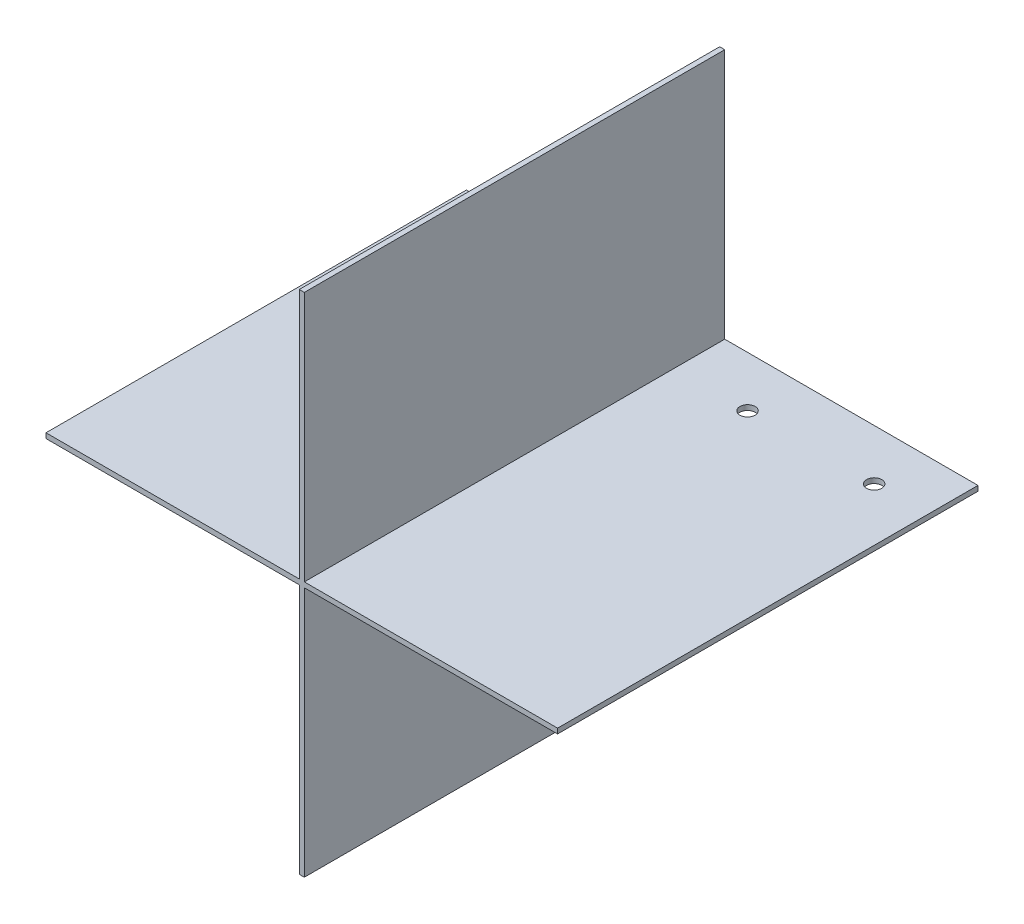
ISO-10303-21;
HEADER;
FILE_DESCRIPTION(('STEP AP214'),'2;1');
FILE_NAME('part.step','',(''),(''),'','','');
FILE_SCHEMA(('AUTOMOTIVE_DESIGN { 1 0 10303 214 1 1 1 1 }'));
ENDSEC;
DATA;
#1=APPLICATION_CONTEXT('core data for automotive mechanical design processes');
#2=APPLICATION_PROTOCOL_DEFINITION('international standard','automotive_design',2000,#1);
#3=PRODUCT_CONTEXT('',#1,'mechanical');
#4=PRODUCT('Part','Part','',(#3));
#5=PRODUCT_RELATED_PRODUCT_CATEGORY('part','',(#4));
#6=PRODUCT_DEFINITION_FORMATION('','',#4);
#7=PRODUCT_DEFINITION_CONTEXT('part definition',#1,'design');
#8=PRODUCT_DEFINITION('design','',#6,#7);
#9=PRODUCT_DEFINITION_SHAPE('','',#8);
#10=(LENGTH_UNIT() NAMED_UNIT(*) SI_UNIT(.MILLI.,.METRE.));
#11=(NAMED_UNIT(*) PLANE_ANGLE_UNIT() SI_UNIT($,.RADIAN.));
#12=(NAMED_UNIT(*) SI_UNIT($,.STERADIAN.) SOLID_ANGLE_UNIT());
#13=UNCERTAINTY_MEASURE_WITH_UNIT(LENGTH_MEASURE(1.E-05),#10,'distance_accuracy_value','');
#14=(GEOMETRIC_REPRESENTATION_CONTEXT(3) GLOBAL_UNCERTAINTY_ASSIGNED_CONTEXT((#13)) GLOBAL_UNIT_ASSIGNED_CONTEXT((#10,
#11,#12)) REPRESENTATION_CONTEXT('',''));
#15=CARTESIAN_POINT('',(0.,0.,0.));
#16=DIRECTION('',(0.,0.,1.));
#17=DIRECTION('',(1.,0.,0.));
#18=AXIS2_PLACEMENT_3D('',#15,#16,#17);
#19=CARTESIAN_POINT('',(-0.5,0.,0.));
#20=DIRECTION('',(1.,0.,0.));
#21=DIRECTION('',(0.,0.,-1.));
#22=AXIS2_PLACEMENT_3D('',#19,#20,#21);
#23=PLANE('',#22);
#24=DIRECTION('',(0.,-1.,0.));
#25=VECTOR('',#24,1.);
#26=CARTESIAN_POINT('',(-0.5,50.,41.5));
#27=LINE('',#26,#25);
#28=CARTESIAN_POINT('',(-0.5,-0.5,41.5));
#29=VERTEX_POINT('',#28);
#30=CARTESIAN_POINT('',(-0.5,-50.,41.5));
#31=VERTEX_POINT('',#30);
#32=EDGE_CURVE('E226',#29,#31,#27,.T.);
#33=ORIENTED_EDGE('',*,*,#32,.F.);
#34=DIRECTION('',(0.,0.,-1.));
#35=VECTOR('',#34,1.);
#36=CARTESIAN_POINT('',(-0.5,-0.5,0.));
#37=LINE('',#36,#35);
#38=CARTESIAN_POINT('',(-0.5,-0.5,-41.5));
#39=VERTEX_POINT('',#38);
#40=EDGE_CURVE('E198',#29,#39,#37,.T.);
#41=ORIENTED_EDGE('',*,*,#40,.T.);
#42=DIRECTION('',(0.,1.,0.));
#43=VECTOR('',#42,1.);
#44=CARTESIAN_POINT('',(-0.5,50.,-41.5));
#45=LINE('',#44,#43);
#46=CARTESIAN_POINT('',(-0.5,-50.,-41.5));
#47=VERTEX_POINT('',#46);
#48=EDGE_CURVE('E218',#47,#39,#45,.T.);
#49=ORIENTED_EDGE('',*,*,#48,.F.);
#50=DIRECTION('',(0.,0.,-1.));
#51=VECTOR('',#50,1.);
#52=CARTESIAN_POINT('',(-0.5,-50.,41.5));
#53=LINE('',#52,#51);
#54=EDGE_CURVE('E231',#31,#47,#53,.T.);
#55=ORIENTED_EDGE('',*,*,#54,.F.);
#56=EDGE_LOOP('',(#33,#41,#49,#55));
#57=FACE_BOUND('',#56,.T.);
#58=ADVANCED_FACE('F38',(#57),#23,.F.);
#59=CARTESIAN_POINT('',(0.5,0.,0.));
#60=DIRECTION('',(1.,0.,0.));
#61=DIRECTION('',(0.,0.,-1.));
#62=AXIS2_PLACEMENT_3D('',#59,#60,#61);
#63=PLANE('',#62);
#64=DIRECTION('',(0.,0.,-1.));
#65=VECTOR('',#64,1.);
#66=CARTESIAN_POINT('',(0.5,-0.5,0.));
#67=LINE('',#66,#65);
#68=CARTESIAN_POINT('',(0.5,-0.5,41.5));
#69=VERTEX_POINT('',#68);
#70=CARTESIAN_POINT('',(0.5,-0.5,-41.5));
#71=VERTEX_POINT('',#70);
#72=EDGE_CURVE('E11',#69,#71,#67,.T.);
#73=ORIENTED_EDGE('',*,*,#72,.F.);
#74=DIRECTION('',(0.,-1.,0.));
#75=VECTOR('',#74,1.);
#76=CARTESIAN_POINT('',(0.5,50.,41.5));
#77=LINE('',#76,#75);
#78=CARTESIAN_POINT('',(0.5,-50.,41.5));
#79=VERTEX_POINT('',#78);
#80=EDGE_CURVE('E209',#69,#79,#77,.T.);
#81=ORIENTED_EDGE('',*,*,#80,.T.);
#82=DIRECTION('',(0.,0.,-1.));
#83=VECTOR('',#82,1.);
#84=CARTESIAN_POINT('',(0.5,-50.,41.5));
#85=LINE('',#84,#83);
#86=CARTESIAN_POINT('',(0.5,-50.,-41.5));
#87=VERTEX_POINT('',#86);
#88=EDGE_CURVE('E213',#79,#87,#85,.T.);
#89=ORIENTED_EDGE('',*,*,#88,.T.);
#90=DIRECTION('',(0.,1.,0.));
#91=VECTOR('',#90,1.);
#92=CARTESIAN_POINT('',(0.5,50.,-41.5));
#93=LINE('',#92,#91);
#94=EDGE_CURVE('E202',#87,#71,#93,.T.);
#95=ORIENTED_EDGE('',*,*,#94,.T.);
#96=EDGE_LOOP('',(#73,#81,#89,#95));
#97=FACE_BOUND('',#96,.T.);
#98=ADVANCED_FACE('F269',(#97),#63,.T.);
#99=CARTESIAN_POINT('',(-0.5,50.,-41.5));
#100=DIRECTION('',(0.,0.,-1.));
#101=DIRECTION('',(-1.,0.,0.));
#102=AXIS2_PLACEMENT_3D('',#99,#100,#101);
#103=PLANE('',#102);
#104=CARTESIAN_POINT('',(0.5,0.5,-41.5));
#105=VERTEX_POINT('',#104);
#106=CARTESIAN_POINT('',(0.5,50.,-41.5));
#107=VERTEX_POINT('',#106);
#108=EDGE_CURVE('E133',#105,#107,#93,.T.);
#109=ORIENTED_EDGE('',*,*,#108,.F.);
#110=DIRECTION('',(1.,0.,0.));
#111=VECTOR('',#110,1.);
#112=CARTESIAN_POINT('',(-50.5,0.5,-41.5));
#113=LINE('',#112,#111);
#114=CARTESIAN_POINT('',(50.5,0.5,-41.5));
#115=VERTEX_POINT('',#114);
#116=EDGE_CURVE('E127',#105,#115,#113,.T.);
#117=ORIENTED_EDGE('',*,*,#116,.T.);
#118=DIRECTION('',(0.,1.,0.));
#119=VECTOR('',#118,1.);
#120=CARTESIAN_POINT('',(50.5,0.5,-41.5));
#121=LINE('',#120,#119);
#122=CARTESIAN_POINT('',(50.5,-0.5,-41.5));
#123=VERTEX_POINT('',#122);
#124=EDGE_CURVE('E131',#123,#115,#121,.T.);
#125=ORIENTED_EDGE('',*,*,#124,.F.);
#126=DIRECTION('',(1.,0.,0.));
#127=VECTOR('',#126,1.);
#128=CARTESIAN_POINT('',(-50.5,-0.5,-41.5));
#129=LINE('',#128,#127);
#130=EDGE_CURVE('E186',#71,#123,#129,.T.);
#131=ORIENTED_EDGE('',*,*,#130,.F.);
#132=ORIENTED_EDGE('',*,*,#94,.F.);
#133=DIRECTION('',(1.,0.,0.));
#134=VECTOR('',#133,1.);
#135=CARTESIAN_POINT('',(-0.5,-50.,-41.5));
#136=LINE('',#135,#134);
#137=EDGE_CURVE('E236',#47,#87,#136,.T.);
#138=ORIENTED_EDGE('',*,*,#137,.F.);
#139=ORIENTED_EDGE('',*,*,#48,.T.);
#140=CARTESIAN_POINT('',(-50.5,-0.5,-41.5));
#141=VERTEX_POINT('',#140);
#142=EDGE_CURVE('E182',#141,#39,#129,.T.);
#143=ORIENTED_EDGE('',*,*,#142,.F.);
#144=DIRECTION('',(0.,1.,0.));
#145=VECTOR('',#144,1.);
#146=CARTESIAN_POINT('',(-50.5,0.5,-41.5));
#147=LINE('',#146,#145);
#148=CARTESIAN_POINT('',(-50.5,0.5,-41.5));
#149=VERTEX_POINT('',#148);
#150=EDGE_CURVE('E168',#141,#149,#147,.T.);
#151=ORIENTED_EDGE('',*,*,#150,.T.);
#152=CARTESIAN_POINT('',(-0.5,0.5,-41.5));
#153=VERTEX_POINT('',#152);
#154=EDGE_CURVE('E137',#149,#153,#113,.T.);
#155=ORIENTED_EDGE('',*,*,#154,.T.);
#156=CARTESIAN_POINT('',(-0.5,50.,-41.5));
#157=VERTEX_POINT('',#156);
#158=EDGE_CURVE('E217',#153,#157,#45,.T.);
#159=ORIENTED_EDGE('',*,*,#158,.T.);
#160=DIRECTION('',(1.,0.,0.));
#161=VECTOR('',#160,1.);
#162=CARTESIAN_POINT('',(-0.5,50.,-41.5));
#163=LINE('',#162,#161);
#164=EDGE_CURVE('E235',#157,#107,#163,.T.);
#165=ORIENTED_EDGE('',*,*,#164,.T.);
#166=EDGE_LOOP('',(#109,#117,#125,#131,#132,#138,#139,#143,#151,#155,#159,#165));
#167=FACE_BOUND('',#166,.T.);
#168=ADVANCED_FACE('F40',(#167),#103,.T.);
#169=CARTESIAN_POINT('',(-0.5,-50.,41.5));
#170=DIRECTION('',(0.,-1.,0.));
#171=DIRECTION('',(0.,0.,-1.));
#172=AXIS2_PLACEMENT_3D('',#169,#170,#171);
#173=PLANE('',#172);
#174=ORIENTED_EDGE('',*,*,#137,.T.);
#175=ORIENTED_EDGE('',*,*,#88,.F.);
#176=DIRECTION('',(1.,0.,0.));
#177=VECTOR('',#176,1.);
#178=CARTESIAN_POINT('',(-0.5,-50.,41.5));
#179=LINE('',#178,#177);
#180=EDGE_CURVE('E239',#31,#79,#179,.T.);
#181=ORIENTED_EDGE('',*,*,#180,.F.);
#182=ORIENTED_EDGE('',*,*,#54,.T.);
#183=EDGE_LOOP('',(#174,#175,#181,#182));
#184=FACE_BOUND('',#183,.T.);
#185=ADVANCED_FACE('F265',(#184),#173,.T.);
#186=CARTESIAN_POINT('',(-0.5,50.,41.5));
#187=DIRECTION('',(0.,0.,1.));
#188=DIRECTION('',(1.,0.,0.));
#189=AXIS2_PLACEMENT_3D('',#186,#187,#188);
#190=PLANE('',#189);
#191=CARTESIAN_POINT('',(-0.5,50.,41.5));
#192=VERTEX_POINT('',#191);
#193=CARTESIAN_POINT('',(-0.5,0.5,41.5));
#194=VERTEX_POINT('',#193);
#195=EDGE_CURVE('E227',#192,#194,#27,.T.);
#196=ORIENTED_EDGE('',*,*,#195,.T.);
#197=DIRECTION('',(1.,0.,0.));
#198=VECTOR('',#197,1.);
#199=CARTESIAN_POINT('',(-50.5,0.5,41.5));
#200=LINE('',#199,#198);
#201=CARTESIAN_POINT('',(-50.5,0.5,41.5));
#202=VERTEX_POINT('',#201);
#203=EDGE_CURVE('E54',#202,#194,#200,.T.);
#204=ORIENTED_EDGE('',*,*,#203,.F.);
#205=DIRECTION('',(0.,-1.,0.));
#206=VECTOR('',#205,1.);
#207=CARTESIAN_POINT('',(-50.5,0.5,41.5));
#208=LINE('',#207,#206);
#209=CARTESIAN_POINT('',(-50.5,-0.5,41.5));
#210=VERTEX_POINT('',#209);
#211=EDGE_CURVE('E175',#202,#210,#208,.T.);
#212=ORIENTED_EDGE('',*,*,#211,.T.);
#213=DIRECTION('',(1.,0.,0.));
#214=VECTOR('',#213,1.);
#215=CARTESIAN_POINT('',(-50.5,-0.5,41.5));
#216=LINE('',#215,#214);
#217=EDGE_CURVE('E187',#210,#29,#216,.T.);
#218=ORIENTED_EDGE('',*,*,#217,.T.);
#219=ORIENTED_EDGE('',*,*,#32,.T.);
#220=ORIENTED_EDGE('',*,*,#180,.T.);
#221=ORIENTED_EDGE('',*,*,#80,.F.);
#222=CARTESIAN_POINT('',(50.5,-0.5,41.5));
#223=VERTEX_POINT('',#222);
#224=EDGE_CURVE('E191',#69,#223,#216,.T.);
#225=ORIENTED_EDGE('',*,*,#224,.T.);
#226=DIRECTION('',(0.,-1.,0.));
#227=VECTOR('',#226,1.);
#228=CARTESIAN_POINT('',(50.5,0.5,41.5));
#229=LINE('',#228,#227);
#230=CARTESIAN_POINT('',(50.5,0.5,41.5));
#231=VERTEX_POINT('',#230);
#232=EDGE_CURVE('E149',#231,#223,#229,.T.);
#233=ORIENTED_EDGE('',*,*,#232,.F.);
#234=CARTESIAN_POINT('',(0.5,0.5,41.5));
#235=VERTEX_POINT('',#234);
#236=EDGE_CURVE('E144',#235,#231,#200,.T.);
#237=ORIENTED_EDGE('',*,*,#236,.F.);
#238=CARTESIAN_POINT('',(0.5,50.,41.5));
#239=VERTEX_POINT('',#238);
#240=EDGE_CURVE('E210',#239,#235,#77,.T.);
#241=ORIENTED_EDGE('',*,*,#240,.F.);
#242=DIRECTION('',(1.,0.,0.));
#243=VECTOR('',#242,1.);
#244=CARTESIAN_POINT('',(-0.5,50.,41.5));
#245=LINE('',#244,#243);
#246=EDGE_CURVE('E243',#192,#239,#245,.T.);
#247=ORIENTED_EDGE('',*,*,#246,.F.);
#248=EDGE_LOOP('',(#196,#204,#212,#218,#219,#220,#221,#225,#233,#237,#241,#247));
#249=FACE_BOUND('',#248,.T.);
#250=ADVANCED_FACE('F251',(#249),#190,.T.);
#251=CARTESIAN_POINT('',(-0.5,50.,41.5));
#252=DIRECTION('',(0.,1.,0.));
#253=DIRECTION('',(0.,0.,1.));
#254=AXIS2_PLACEMENT_3D('',#251,#252,#253);
#255=PLANE('',#254);
#256=ORIENTED_EDGE('',*,*,#246,.T.);
#257=DIRECTION('',(0.,0.,1.));
#258=VECTOR('',#257,1.);
#259=CARTESIAN_POINT('',(0.5,50.,41.5));
#260=LINE('',#259,#258);
#261=EDGE_CURVE('E205',#107,#239,#260,.T.);
#262=ORIENTED_EDGE('',*,*,#261,.F.);
#263=ORIENTED_EDGE('',*,*,#164,.F.);
#264=DIRECTION('',(0.,0.,1.));
#265=VECTOR('',#264,1.);
#266=CARTESIAN_POINT('',(-0.5,50.,41.5));
#267=LINE('',#266,#265);
#268=EDGE_CURVE('E222',#157,#192,#267,.T.);
#269=ORIENTED_EDGE('',*,*,#268,.T.);
#270=EDGE_LOOP('',(#256,#262,#263,#269));
#271=FACE_BOUND('',#270,.T.);
#272=ADVANCED_FACE('F298',(#271),#255,.T.);
#273=ORIENTED_EDGE('',*,*,#158,.F.);
#274=DIRECTION('',(0.,0.,1.));
#275=VECTOR('',#274,1.);
#276=CARTESIAN_POINT('',(-0.5,0.5,0.));
#277=LINE('',#276,#275);
#278=EDGE_CURVE('E185',#153,#194,#277,.T.);
#279=ORIENTED_EDGE('',*,*,#278,.T.);
#280=ORIENTED_EDGE('',*,*,#195,.F.);
#281=ORIENTED_EDGE('',*,*,#268,.F.);
#282=EDGE_LOOP('',(#273,#279,#280,#281));
#283=FACE_BOUND('',#282,.T.);
#284=ADVANCED_FACE('F290',(#283),#23,.F.);
#285=DIRECTION('',(0.,0.,1.));
#286=VECTOR('',#285,1.);
#287=CARTESIAN_POINT('',(0.5,0.5,0.));
#288=LINE('',#287,#286);
#289=EDGE_CURVE('E47',#105,#235,#288,.T.);
#290=ORIENTED_EDGE('',*,*,#289,.F.);
#291=ORIENTED_EDGE('',*,*,#108,.T.);
#292=ORIENTED_EDGE('',*,*,#261,.T.);
#293=ORIENTED_EDGE('',*,*,#240,.T.);
#294=EDGE_LOOP('',(#290,#291,#292,#293));
#295=FACE_BOUND('',#294,.T.);
#296=ADVANCED_FACE('F295',(#295),#63,.T.);
#297=CARTESIAN_POINT('',(50.5,0.,0.));
#298=DIRECTION('',(1.,0.,0.));
#299=DIRECTION('',(0.,0.,-1.));
#300=AXIS2_PLACEMENT_3D('',#297,#298,#299);
#301=PLANE('',#300);
#302=ORIENTED_EDGE('',*,*,#124,.T.);
#303=DIRECTION('',(0.,0.,1.));
#304=VECTOR('',#303,1.);
#305=CARTESIAN_POINT('',(50.5,0.5,41.5));
#306=LINE('',#305,#304);
#307=EDGE_CURVE('E141',#115,#231,#306,.T.);
#308=ORIENTED_EDGE('',*,*,#307,.T.);
#309=ORIENTED_EDGE('',*,*,#232,.T.);
#310=DIRECTION('',(0.,0.,-1.));
#311=VECTOR('',#310,1.);
#312=CARTESIAN_POINT('',(50.5,-0.5,41.5));
#313=LINE('',#312,#311);
#314=EDGE_CURVE('E154',#223,#123,#313,.T.);
#315=ORIENTED_EDGE('',*,*,#314,.T.);
#316=EDGE_LOOP('',(#302,#308,#309,#315));
#317=FACE_BOUND('',#316,.T.);
#318=ADVANCED_FACE('F152',(#317),#301,.T.);
#319=CARTESIAN_POINT('',(-50.5,0.5,41.5));
#320=DIRECTION('',(0.,1.,0.));
#321=DIRECTION('',(0.,0.,1.));
#322=AXIS2_PLACEMENT_3D('',#319,#320,#321);
#323=PLANE('',#322);
#324=CARTESIAN_POINT('',(40.,0.5,-31.5));
#325=DIRECTION('',(0.,1.,0.));
#326=DIRECTION('',(0.,0.,1.));
#327=AXIS2_PLACEMENT_3D('',#324,#325,#326);
#328=CIRCLE('',#327,1.5);
#329=CARTESIAN_POINT('',(40.,0.5,-30.));
#330=VERTEX_POINT('',#329);
#331=EDGE_CURVE('E341',#330,#330,#328,.T.);
#332=ORIENTED_EDGE('',*,*,#331,.F.);
#333=EDGE_LOOP('',(#332));
#334=FACE_BOUND('',#333,.T.);
#335=CARTESIAN_POINT('',(15.,0.5,-31.5));
#336=DIRECTION('',(0.,1.,0.));
#337=DIRECTION('',(0.,0.,1.));
#338=AXIS2_PLACEMENT_3D('',#335,#336,#337);
#339=CIRCLE('',#338,1.5);
#340=CARTESIAN_POINT('',(15.,0.5,-30.));
#341=VERTEX_POINT('',#340);
#342=EDGE_CURVE('E156',#341,#341,#339,.T.);
#343=ORIENTED_EDGE('',*,*,#342,.F.);
#344=EDGE_LOOP('',(#343));
#345=FACE_BOUND('',#344,.T.);
#346=ORIENTED_EDGE('',*,*,#116,.F.);
#347=ORIENTED_EDGE('',*,*,#289,.T.);
#348=ORIENTED_EDGE('',*,*,#236,.T.);
#349=ORIENTED_EDGE('',*,*,#307,.F.);
#350=EDGE_LOOP('',(#346,#347,#348,#349));
#351=FACE_BOUND('',#350,.T.);
#352=ADVANCED_FACE('F142',(#334,#345,#351),#323,.T.);
#353=CARTESIAN_POINT('',(-50.5,-0.5,41.5));
#354=DIRECTION('',(0.,-1.,0.));
#355=DIRECTION('',(0.,0.,-1.));
#356=AXIS2_PLACEMENT_3D('',#353,#354,#355);
#357=PLANE('',#356);
#358=CARTESIAN_POINT('',(40.,-0.5,-31.5));
#359=DIRECTION('',(0.,-1.,0.));
#360=DIRECTION('',(0.,0.,-1.));
#361=AXIS2_PLACEMENT_3D('',#358,#359,#360);
#362=CIRCLE('',#361,1.5);
#363=CARTESIAN_POINT('',(40.,-0.5,-33.));
#364=VERTEX_POINT('',#363);
#365=EDGE_CURVE('E345',#364,#364,#362,.F.);
#366=ORIENTED_EDGE('',*,*,#365,.T.);
#367=EDGE_LOOP('',(#366));
#368=FACE_BOUND('',#367,.T.);
#369=CARTESIAN_POINT('',(15.,-0.5,-31.5));
#370=DIRECTION('',(0.,-1.,0.));
#371=DIRECTION('',(0.,0.,-1.));
#372=AXIS2_PLACEMENT_3D('',#369,#370,#371);
#373=CIRCLE('',#372,1.5);
#374=CARTESIAN_POINT('',(15.,-0.5,-33.));
#375=VERTEX_POINT('',#374);
#376=EDGE_CURVE('E160',#375,#375,#373,.F.);
#377=ORIENTED_EDGE('',*,*,#376,.T.);
#378=EDGE_LOOP('',(#377));
#379=FACE_BOUND('',#378,.T.);
#380=ORIENTED_EDGE('',*,*,#224,.F.);
#381=ORIENTED_EDGE('',*,*,#72,.T.);
#382=ORIENTED_EDGE('',*,*,#130,.T.);
#383=ORIENTED_EDGE('',*,*,#314,.F.);
#384=EDGE_LOOP('',(#380,#381,#382,#383));
#385=FACE_BOUND('',#384,.T.);
#386=ADVANCED_FACE('F272',(#368,#379,#385),#357,.T.);
#387=CARTESIAN_POINT('',(-40.,-0.5,-31.5));
#388=DIRECTION('',(0.,-1.,0.));
#389=DIRECTION('',(0.,0.,-1.));
#390=AXIS2_PLACEMENT_3D('',#387,#388,#389);
#391=CIRCLE('',#390,1.5);
#392=CARTESIAN_POINT('',(-40.,-0.5,-33.));
#393=VERTEX_POINT('',#392);
#394=EDGE_CURVE('E331',#393,#393,#391,.F.);
#395=ORIENTED_EDGE('',*,*,#394,.T.);
#396=EDGE_LOOP('',(#395));
#397=FACE_BOUND('',#396,.T.);
#398=CARTESIAN_POINT('',(-15.,-0.5,-31.5));
#399=DIRECTION('',(0.,-1.,0.));
#400=DIRECTION('',(0.,0.,-1.));
#401=AXIS2_PLACEMENT_3D('',#398,#399,#400);
#402=CIRCLE('',#401,1.5);
#403=CARTESIAN_POINT('',(-15.,-0.5,-33.));
#404=VERTEX_POINT('',#403);
#405=EDGE_CURVE('E332',#404,#404,#402,.F.);
#406=ORIENTED_EDGE('',*,*,#405,.T.);
#407=EDGE_LOOP('',(#406));
#408=FACE_BOUND('',#407,.T.);
#409=ORIENTED_EDGE('',*,*,#40,.F.);
#410=ORIENTED_EDGE('',*,*,#217,.F.);
#411=DIRECTION('',(0.,0.,-1.));
#412=VECTOR('',#411,1.);
#413=CARTESIAN_POINT('',(-50.5,-0.5,41.5));
#414=LINE('',#413,#412);
#415=EDGE_CURVE('E138',#210,#141,#414,.T.);
#416=ORIENTED_EDGE('',*,*,#415,.T.);
#417=ORIENTED_EDGE('',*,*,#142,.T.);
#418=EDGE_LOOP('',(#409,#410,#416,#417));
#419=FACE_BOUND('',#418,.T.);
#420=ADVANCED_FACE('F274',(#397,#408,#419),#357,.T.);
#421=CARTESIAN_POINT('',(-40.,0.5,-31.5));
#422=DIRECTION('',(0.,1.,0.));
#423=DIRECTION('',(0.,0.,-1.));
#424=AXIS2_PLACEMENT_3D('',#421,#422,#423);
#425=CIRCLE('',#424,1.5);
#426=CARTESIAN_POINT('',(-40.,0.5,-33.));
#427=VERTEX_POINT('',#426);
#428=EDGE_CURVE('E325',#427,#427,#425,.T.);
#429=ORIENTED_EDGE('',*,*,#428,.F.);
#430=EDGE_LOOP('',(#429));
#431=FACE_BOUND('',#430,.T.);
#432=CARTESIAN_POINT('',(-15.,0.5,-31.5));
#433=DIRECTION('',(0.,1.,0.));
#434=DIRECTION('',(0.,0.,-1.));
#435=AXIS2_PLACEMENT_3D('',#432,#433,#434);
#436=CIRCLE('',#435,1.5);
#437=CARTESIAN_POINT('',(-15.,0.5,-33.));
#438=VERTEX_POINT('',#437);
#439=EDGE_CURVE('E328',#438,#438,#436,.T.);
#440=ORIENTED_EDGE('',*,*,#439,.F.);
#441=EDGE_LOOP('',(#440));
#442=FACE_BOUND('',#441,.T.);
#443=ORIENTED_EDGE('',*,*,#278,.F.);
#444=ORIENTED_EDGE('',*,*,#154,.F.);
#445=DIRECTION('',(0.,0.,1.));
#446=VECTOR('',#445,1.);
#447=CARTESIAN_POINT('',(-50.5,0.5,41.5));
#448=LINE('',#447,#446);
#449=EDGE_CURVE('E172',#149,#202,#448,.T.);
#450=ORIENTED_EDGE('',*,*,#449,.T.);
#451=ORIENTED_EDGE('',*,*,#203,.T.);
#452=EDGE_LOOP('',(#443,#444,#450,#451));
#453=FACE_BOUND('',#452,.T.);
#454=ADVANCED_FACE('F281',(#431,#442,#453),#323,.T.);
#455=CARTESIAN_POINT('',(-50.5,0.,0.));
#456=DIRECTION('',(1.,0.,0.));
#457=DIRECTION('',(0.,0.,-1.));
#458=AXIS2_PLACEMENT_3D('',#455,#456,#457);
#459=PLANE('',#458);
#460=ORIENTED_EDGE('',*,*,#150,.F.);
#461=ORIENTED_EDGE('',*,*,#415,.F.);
#462=ORIENTED_EDGE('',*,*,#211,.F.);
#463=ORIENTED_EDGE('',*,*,#449,.F.);
#464=EDGE_LOOP('',(#460,#461,#462,#463));
#465=FACE_BOUND('',#464,.T.);
#466=ADVANCED_FACE('F314',(#465),#459,.F.);
#467=CARTESIAN_POINT('',(-15.,-50.001,-31.5));
#468=DIRECTION('',(0.,1.,0.));
#469=DIRECTION('',(0.,0.,1.));
#470=AXIS2_PLACEMENT_3D('',#467,#468,#469);
#471=CYLINDRICAL_SURFACE('',#470,1.5);
#472=ORIENTED_EDGE('',*,*,#405,.F.);
#473=EDGE_LOOP('',(#472));
#474=FACE_BOUND('',#473,.T.);
#475=ORIENTED_EDGE('',*,*,#439,.T.);
#476=EDGE_LOOP('',(#475));
#477=FACE_BOUND('',#476,.T.);
#478=ADVANCED_FACE('F321',(#474,#477),#471,.F.);
#479=CARTESIAN_POINT('',(-40.,-50.001,-31.5));
#480=DIRECTION('',(0.,1.,0.));
#481=DIRECTION('',(0.,0.,1.));
#482=AXIS2_PLACEMENT_3D('',#479,#480,#481);
#483=CYLINDRICAL_SURFACE('',#482,1.5);
#484=ORIENTED_EDGE('',*,*,#394,.F.);
#485=EDGE_LOOP('',(#484));
#486=FACE_BOUND('',#485,.T.);
#487=ORIENTED_EDGE('',*,*,#428,.T.);
#488=EDGE_LOOP('',(#487));
#489=FACE_BOUND('',#488,.T.);
#490=ADVANCED_FACE('F350',(#486,#489),#483,.F.);
#491=CARTESIAN_POINT('',(15.,-50.001,-31.5));
#492=DIRECTION('',(0.,1.,0.));
#493=DIRECTION('',(0.,0.,1.));
#494=AXIS2_PLACEMENT_3D('',#491,#492,#493);
#495=CYLINDRICAL_SURFACE('',#494,1.5);
#496=ORIENTED_EDGE('',*,*,#376,.F.);
#497=EDGE_LOOP('',(#496));
#498=FACE_BOUND('',#497,.T.);
#499=ORIENTED_EDGE('',*,*,#342,.T.);
#500=EDGE_LOOP('',(#499));
#501=FACE_BOUND('',#500,.T.);
#502=ADVANCED_FACE('F352',(#498,#501),#495,.F.);
#503=CARTESIAN_POINT('',(40.,-50.001,-31.5));
#504=DIRECTION('',(0.,1.,0.));
#505=DIRECTION('',(0.,0.,1.));
#506=AXIS2_PLACEMENT_3D('',#503,#504,#505);
#507=CYLINDRICAL_SURFACE('',#506,1.5);
#508=ORIENTED_EDGE('',*,*,#365,.F.);
#509=EDGE_LOOP('',(#508));
#510=FACE_BOUND('',#509,.T.);
#511=ORIENTED_EDGE('',*,*,#331,.T.);
#512=EDGE_LOOP('',(#511));
#513=FACE_BOUND('',#512,.T.);
#514=ADVANCED_FACE('F359',(#510,#513),#507,.F.);
#515=CLOSED_SHELL('',(#58,#98,#168,#185,#250,#272,#284,#296,#318,#352,#386,#420,#454,#466,#478,
#490,#502,#514));
#516=MANIFOLD_SOLID_BREP('B2',#515);
#517=ADVANCED_BREP_SHAPE_REPRESENTATION('',(#18,#516),#14);
#518=SHAPE_DEFINITION_REPRESENTATION(#9,#517);
ENDSEC;
END-ISO-10303-21;
